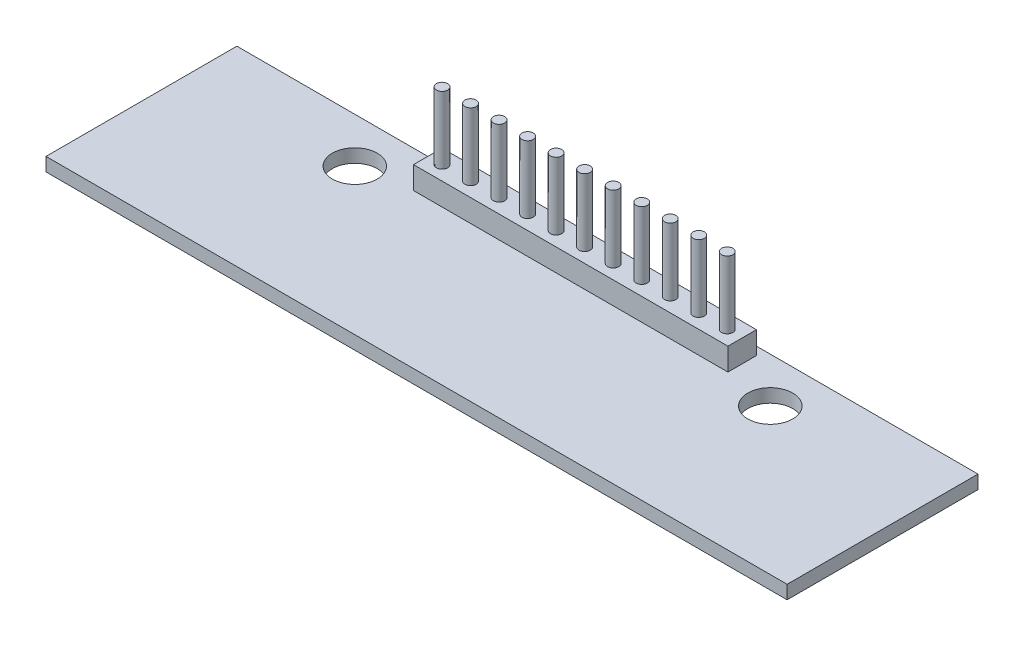
ISO-10303-21;
HEADER;
FILE_DESCRIPTION(('STEP AP214'),'2;1');
FILE_NAME('part.step','',(''),(''),'','','');
FILE_SCHEMA(('AUTOMOTIVE_DESIGN { 1 0 10303 214 1 1 1 1 }'));
ENDSEC;
DATA;
#1=APPLICATION_CONTEXT('core data for automotive mechanical design processes');
#2=APPLICATION_PROTOCOL_DEFINITION('international standard','automotive_design',2000,#1);
#3=PRODUCT_CONTEXT('',#1,'mechanical');
#4=PRODUCT('Part','Part','',(#3));
#5=PRODUCT_RELATED_PRODUCT_CATEGORY('part','',(#4));
#6=PRODUCT_DEFINITION_FORMATION('','',#4);
#7=PRODUCT_DEFINITION_CONTEXT('part definition',#1,'design');
#8=PRODUCT_DEFINITION('design','',#6,#7);
#9=PRODUCT_DEFINITION_SHAPE('','',#8);
#10=(LENGTH_UNIT() NAMED_UNIT(*) SI_UNIT(.MILLI.,.METRE.));
#11=(NAMED_UNIT(*) PLANE_ANGLE_UNIT() SI_UNIT($,.RADIAN.));
#12=(NAMED_UNIT(*) SI_UNIT($,.STERADIAN.) SOLID_ANGLE_UNIT());
#13=UNCERTAINTY_MEASURE_WITH_UNIT(LENGTH_MEASURE(1.E-05),#10,'distance_accuracy_value','');
#14=(GEOMETRIC_REPRESENTATION_CONTEXT(3) GLOBAL_UNCERTAINTY_ASSIGNED_CONTEXT((#13)) GLOBAL_UNIT_ASSIGNED_CONTEXT((#10,
#11,#12)) REPRESENTATION_CONTEXT('',''));
#15=CARTESIAN_POINT('',(0.,0.,0.));
#16=DIRECTION('',(0.,0.,1.));
#17=DIRECTION('',(1.,0.,0.));
#18=AXIS2_PLACEMENT_3D('',#15,#16,#17);
#19=CARTESIAN_POINT('',(0.,1.2,0.));
#20=DIRECTION('',(0.,1.,0.));
#21=DIRECTION('',(0.,0.,1.));
#22=AXIS2_PLACEMENT_3D('',#19,#20,#21);
#23=PLANE('',#22);
#24=CARTESIAN_POINT('',(18.5,1.2,-4.50000000000002));
#25=DIRECTION('',(0.,1.,0.));
#26=DIRECTION('',(0.,0.,1.));
#27=AXIS2_PLACEMENT_3D('',#24,#25,#26);
#28=CIRCLE('',#27,2.);
#29=CARTESIAN_POINT('',(18.5,1.2,-2.50000000000002));
#30=VERTEX_POINT('',#29);
#31=EDGE_CURVE('E148',#30,#30,#28,.T.);
#32=ORIENTED_EDGE('',*,*,#31,.F.);
#33=EDGE_LOOP('',(#32));
#34=FACE_BOUND('',#33,.T.);
#35=DIRECTION('',(0.,0.,-1.));
#36=VECTOR('',#35,1.);
#37=CARTESIAN_POINT('',(33.,1.2,-8.49999999999998));
#38=LINE('',#37,#36);
#39=CARTESIAN_POINT('',(33.,1.2,8.49999999999998));
#40=VERTEX_POINT('',#39);
#41=CARTESIAN_POINT('',(33.,1.2,-8.49999999999998));
#42=VERTEX_POINT('',#41);
#43=EDGE_CURVE('E154',#40,#42,#38,.T.);
#44=ORIENTED_EDGE('',*,*,#43,.T.);
#45=DIRECTION('',(-1.,0.,0.));
#46=VECTOR('',#45,1.);
#47=CARTESIAN_POINT('',(-33.,1.2,-8.50000000000002));
#48=LINE('',#47,#46);
#49=CARTESIAN_POINT('',(-33.,1.2,-8.50000000000002));
#50=VERTEX_POINT('',#49);
#51=EDGE_CURVE('E90',#42,#50,#48,.T.);
#52=ORIENTED_EDGE('',*,*,#51,.T.);
#53=DIRECTION('',(0.,0.,1.));
#54=VECTOR('',#53,1.);
#55=CARTESIAN_POINT('',(-33.,1.2,-8.50000000000002));
#56=LINE('',#55,#54);
#57=CARTESIAN_POINT('',(-33.,1.2,8.49999999999998));
#58=VERTEX_POINT('',#57);
#59=EDGE_CURVE('E157',#50,#58,#56,.T.);
#60=ORIENTED_EDGE('',*,*,#59,.T.);
#61=DIRECTION('',(1.,0.,0.));
#62=VECTOR('',#61,1.);
#63=CARTESIAN_POINT('',(-33.,1.2,8.49999999999998));
#64=LINE('',#63,#62);
#65=EDGE_CURVE('E62',#58,#40,#64,.T.);
#66=ORIENTED_EDGE('',*,*,#65,.T.);
#67=EDGE_LOOP('',(#44,#52,#60,#66));
#68=FACE_BOUND('',#67,.T.);
#69=CARTESIAN_POINT('',(-18.5,1.2,-4.50000000000001));
#70=DIRECTION('',(0.,1.,0.));
#71=DIRECTION('',(0.,0.,-1.));
#72=AXIS2_PLACEMENT_3D('',#69,#70,#71);
#73=CIRCLE('',#72,2.);
#74=CARTESIAN_POINT('',(-18.5,1.2,-6.50000000000001));
#75=VERTEX_POINT('',#74);
#76=EDGE_CURVE('E140',#75,#75,#73,.T.);
#77=ORIENTED_EDGE('',*,*,#76,.F.);
#78=EDGE_LOOP('',(#77));
#79=FACE_BOUND('',#78,.T.);
#80=DIRECTION('',(-1.,0.,0.));
#81=VECTOR('',#80,1.);
#82=CARTESIAN_POINT('',(-14.,1.2,-7.77000000000003));
#83=LINE('',#82,#81);
#84=CARTESIAN_POINT('',(14.,1.2,-7.77000000000003));
#85=VERTEX_POINT('',#84);
#86=CARTESIAN_POINT('',(-14.,1.2,-7.77000000000003));
#87=VERTEX_POINT('',#86);
#88=EDGE_CURVE('E383',#85,#87,#83,.T.);
#89=ORIENTED_EDGE('',*,*,#88,.F.);
#90=DIRECTION('',(0.,0.,-1.));
#91=VECTOR('',#90,1.);
#92=CARTESIAN_POINT('',(14.,1.2,-7.77000000000003));
#93=LINE('',#92,#91);
#94=CARTESIAN_POINT('',(14.,1.2,-5.23000000000003));
#95=VERTEX_POINT('',#94);
#96=EDGE_CURVE('E135',#95,#85,#93,.T.);
#97=ORIENTED_EDGE('',*,*,#96,.F.);
#98=DIRECTION('',(1.,0.,0.));
#99=VECTOR('',#98,1.);
#100=CARTESIAN_POINT('',(-14.,1.2,-5.23000000000003));
#101=LINE('',#100,#99);
#102=CARTESIAN_POINT('',(-14.,1.2,-5.23000000000003));
#103=VERTEX_POINT('',#102);
#104=EDGE_CURVE('E131',#103,#95,#101,.T.);
#105=ORIENTED_EDGE('',*,*,#104,.F.);
#106=DIRECTION('',(0.,0.,1.));
#107=VECTOR('',#106,1.);
#108=CARTESIAN_POINT('',(-14.,1.2,-7.77000000000003));
#109=LINE('',#108,#107);
#110=EDGE_CURVE('E385',#87,#103,#109,.T.);
#111=ORIENTED_EDGE('',*,*,#110,.F.);
#112=EDGE_LOOP('',(#89,#97,#105,#111));
#113=FACE_BOUND('',#112,.T.);
#114=ADVANCED_FACE('F38',(#34,#68,#79,#113),#23,.T.);
#115=CARTESIAN_POINT('',(0.,0.,0.));
#116=DIRECTION('',(0.,1.,0.));
#117=DIRECTION('',(0.,0.,1.));
#118=AXIS2_PLACEMENT_3D('',#115,#116,#117);
#119=PLANE('',#118);
#120=DIRECTION('',(0.,0.,-1.));
#121=VECTOR('',#120,1.);
#122=CARTESIAN_POINT('',(33.,0.,-8.49999999999998));
#123=LINE('',#122,#121);
#124=CARTESIAN_POINT('',(33.,0.,8.49999999999998));
#125=VERTEX_POINT('',#124);
#126=CARTESIAN_POINT('',(33.,0.,-8.49999999999998));
#127=VERTEX_POINT('',#126);
#128=EDGE_CURVE('E151',#125,#127,#123,.T.);
#129=ORIENTED_EDGE('',*,*,#128,.F.);
#130=DIRECTION('',(1.,0.,0.));
#131=VECTOR('',#130,1.);
#132=CARTESIAN_POINT('',(-33.,0.,8.49999999999998));
#133=LINE('',#132,#131);
#134=CARTESIAN_POINT('',(-33.,0.,8.49999999999998));
#135=VERTEX_POINT('',#134);
#136=EDGE_CURVE('E83',#135,#125,#133,.T.);
#137=ORIENTED_EDGE('',*,*,#136,.F.);
#138=DIRECTION('',(0.,0.,1.));
#139=VECTOR('',#138,1.);
#140=CARTESIAN_POINT('',(-33.,0.,-8.50000000000002));
#141=LINE('',#140,#139);
#142=CARTESIAN_POINT('',(-33.,0.,-8.50000000000002));
#143=VERTEX_POINT('',#142);
#144=EDGE_CURVE('E165',#143,#135,#141,.T.);
#145=ORIENTED_EDGE('',*,*,#144,.F.);
#146=DIRECTION('',(-1.,0.,0.));
#147=VECTOR('',#146,1.);
#148=CARTESIAN_POINT('',(-33.,0.,-8.50000000000002));
#149=LINE('',#148,#147);
#150=EDGE_CURVE('E163',#127,#143,#149,.T.);
#151=ORIENTED_EDGE('',*,*,#150,.F.);
#152=EDGE_LOOP('',(#129,#137,#145,#151));
#153=FACE_BOUND('',#152,.T.);
#154=CARTESIAN_POINT('',(18.5,0.,-4.50000000000002));
#155=DIRECTION('',(0.,1.,0.));
#156=DIRECTION('',(0.,0.,1.));
#157=AXIS2_PLACEMENT_3D('',#154,#155,#156);
#158=CIRCLE('',#157,2.);
#159=CARTESIAN_POINT('',(18.5,0.,-2.50000000000002));
#160=VERTEX_POINT('',#159);
#161=EDGE_CURVE('E146',#160,#160,#158,.T.);
#162=ORIENTED_EDGE('',*,*,#161,.T.);
#163=EDGE_LOOP('',(#162));
#164=FACE_BOUND('',#163,.T.);
#165=CARTESIAN_POINT('',(-18.5,0.,-4.50000000000001));
#166=DIRECTION('',(0.,1.,0.));
#167=DIRECTION('',(0.,0.,-1.));
#168=AXIS2_PLACEMENT_3D('',#165,#166,#167);
#169=CIRCLE('',#168,2.);
#170=CARTESIAN_POINT('',(-18.5,0.,-6.50000000000001));
#171=VERTEX_POINT('',#170);
#172=EDGE_CURVE('E137',#171,#171,#169,.T.);
#173=ORIENTED_EDGE('',*,*,#172,.T.);
#174=EDGE_LOOP('',(#173));
#175=FACE_BOUND('',#174,.T.);
#176=ADVANCED_FACE('F178',(#153,#164,#175),#119,.F.);
#177=CARTESIAN_POINT('',(33.,1.2,-8.49999999999998));
#178=DIRECTION('',(-1.,0.,0.));
#179=DIRECTION('',(0.,0.,1.));
#180=AXIS2_PLACEMENT_3D('',#177,#178,#179);
#181=PLANE('',#180);
#182=ORIENTED_EDGE('',*,*,#128,.T.);
#183=DIRECTION('',(0.,-1.,0.));
#184=VECTOR('',#183,1.);
#185=CARTESIAN_POINT('',(33.,1.2,-8.49999999999998));
#186=LINE('',#185,#184);
#187=EDGE_CURVE('E11',#42,#127,#186,.T.);
#188=ORIENTED_EDGE('',*,*,#187,.F.);
#189=ORIENTED_EDGE('',*,*,#43,.F.);
#190=DIRECTION('',(0.,-1.,0.));
#191=VECTOR('',#190,1.);
#192=CARTESIAN_POINT('',(33.,1.2,8.49999999999998));
#193=LINE('',#192,#191);
#194=EDGE_CURVE('E160',#40,#125,#193,.T.);
#195=ORIENTED_EDGE('',*,*,#194,.T.);
#196=EDGE_LOOP('',(#182,#188,#189,#195));
#197=FACE_BOUND('',#196,.T.);
#198=ADVANCED_FACE('F40',(#197),#181,.F.);
#199=CARTESIAN_POINT('',(-33.,1.2,-8.50000000000002));
#200=DIRECTION('',(0.,0.,1.));
#201=DIRECTION('',(1.,0.,0.));
#202=AXIS2_PLACEMENT_3D('',#199,#200,#201);
#203=PLANE('',#202);
#204=ORIENTED_EDGE('',*,*,#150,.T.);
#205=DIRECTION('',(0.,-1.,0.));
#206=VECTOR('',#205,1.);
#207=CARTESIAN_POINT('',(-33.,1.2,-8.50000000000002));
#208=LINE('',#207,#206);
#209=EDGE_CURVE('E46',#50,#143,#208,.T.);
#210=ORIENTED_EDGE('',*,*,#209,.F.);
#211=ORIENTED_EDGE('',*,*,#51,.F.);
#212=ORIENTED_EDGE('',*,*,#187,.T.);
#213=EDGE_LOOP('',(#204,#210,#211,#212));
#214=FACE_BOUND('',#213,.T.);
#215=ADVANCED_FACE('F194',(#214),#203,.F.);
#216=CARTESIAN_POINT('',(-33.,1.2,-8.50000000000002));
#217=DIRECTION('',(1.,0.,0.));
#218=DIRECTION('',(0.,0.,-1.));
#219=AXIS2_PLACEMENT_3D('',#216,#217,#218);
#220=PLANE('',#219);
#221=ORIENTED_EDGE('',*,*,#144,.T.);
#222=DIRECTION('',(0.,-1.,0.));
#223=VECTOR('',#222,1.);
#224=CARTESIAN_POINT('',(-33.,1.2,8.49999999999998));
#225=LINE('',#224,#223);
#226=EDGE_CURVE('E169',#58,#135,#225,.T.);
#227=ORIENTED_EDGE('',*,*,#226,.F.);
#228=ORIENTED_EDGE('',*,*,#59,.F.);
#229=ORIENTED_EDGE('',*,*,#209,.T.);
#230=EDGE_LOOP('',(#221,#227,#228,#229));
#231=FACE_BOUND('',#230,.T.);
#232=ADVANCED_FACE('F174',(#231),#220,.F.);
#233=CARTESIAN_POINT('',(-33.,1.2,8.49999999999998));
#234=DIRECTION('',(0.,0.,-1.));
#235=DIRECTION('',(-1.,0.,0.));
#236=AXIS2_PLACEMENT_3D('',#233,#234,#235);
#237=PLANE('',#236);
#238=ORIENTED_EDGE('',*,*,#136,.T.);
#239=ORIENTED_EDGE('',*,*,#194,.F.);
#240=ORIENTED_EDGE('',*,*,#65,.F.);
#241=ORIENTED_EDGE('',*,*,#226,.T.);
#242=EDGE_LOOP('',(#238,#239,#240,#241));
#243=FACE_BOUND('',#242,.T.);
#244=ADVANCED_FACE('F183',(#243),#237,.F.);
#245=CARTESIAN_POINT('',(18.5,1.2,-4.50000000000002));
#246=DIRECTION('',(0.,-1.,0.));
#247=DIRECTION('',(0.,0.,-1.));
#248=AXIS2_PLACEMENT_3D('',#245,#246,#247);
#249=CYLINDRICAL_SURFACE('',#248,2.);
#250=ORIENTED_EDGE('',*,*,#31,.T.);
#251=EDGE_LOOP('',(#250));
#252=FACE_BOUND('',#251,.T.);
#253=ORIENTED_EDGE('',*,*,#161,.F.);
#254=EDGE_LOOP('',(#253));
#255=FACE_BOUND('',#254,.T.);
#256=ADVANCED_FACE('F185',(#252,#255),#249,.F.);
#257=CARTESIAN_POINT('',(-18.5,1.2,-4.50000000000001));
#258=DIRECTION('',(0.,-1.,0.));
#259=DIRECTION('',(0.,0.,-1.));
#260=AXIS2_PLACEMENT_3D('',#257,#258,#259);
#261=CYLINDRICAL_SURFACE('',#260,2.);
#262=ORIENTED_EDGE('',*,*,#76,.T.);
#263=EDGE_LOOP('',(#262));
#264=FACE_BOUND('',#263,.T.);
#265=ORIENTED_EDGE('',*,*,#172,.F.);
#266=EDGE_LOOP('',(#265));
#267=FACE_BOUND('',#266,.T.);
#268=ADVANCED_FACE('F191',(#264,#267),#261,.F.);
#269=CARTESIAN_POINT('',(14.,3.2,-7.77000000000003));
#270=DIRECTION('',(-1.,0.,0.));
#271=DIRECTION('',(0.,0.,1.));
#272=AXIS2_PLACEMENT_3D('',#269,#270,#271);
#273=PLANE('',#272);
#274=ORIENTED_EDGE('',*,*,#96,.T.);
#275=DIRECTION('',(0.,-1.,0.));
#276=VECTOR('',#275,1.);
#277=CARTESIAN_POINT('',(14.,3.2,-7.77000000000003));
#278=LINE('',#277,#276);
#279=CARTESIAN_POINT('',(14.,3.2,-7.77000000000003));
#280=VERTEX_POINT('',#279);
#281=EDGE_CURVE('E116',#280,#85,#278,.T.);
#282=ORIENTED_EDGE('',*,*,#281,.F.);
#283=DIRECTION('',(0.,0.,-1.));
#284=VECTOR('',#283,1.);
#285=CARTESIAN_POINT('',(14.,3.2,-7.77000000000003));
#286=LINE('',#285,#284);
#287=CARTESIAN_POINT('',(14.,3.2,-5.23000000000003));
#288=VERTEX_POINT('',#287);
#289=EDGE_CURVE('E123',#288,#280,#286,.T.);
#290=ORIENTED_EDGE('',*,*,#289,.F.);
#291=DIRECTION('',(0.,-1.,0.));
#292=VECTOR('',#291,1.);
#293=CARTESIAN_POINT('',(14.,3.2,-5.23000000000003));
#294=LINE('',#293,#292);
#295=EDGE_CURVE('E381',#288,#95,#294,.T.);
#296=ORIENTED_EDGE('',*,*,#295,.T.);
#297=EDGE_LOOP('',(#274,#282,#290,#296));
#298=FACE_BOUND('',#297,.T.);
#299=ADVANCED_FACE('F133',(#298),#273,.F.);
#300=CARTESIAN_POINT('',(-14.,3.2,-7.77000000000003));
#301=DIRECTION('',(0.,0.,1.));
#302=DIRECTION('',(1.,0.,0.));
#303=AXIS2_PLACEMENT_3D('',#300,#301,#302);
#304=PLANE('',#303);
#305=ORIENTED_EDGE('',*,*,#88,.T.);
#306=DIRECTION('',(0.,-1.,0.));
#307=VECTOR('',#306,1.);
#308=CARTESIAN_POINT('',(-14.,3.2,-7.77000000000003));
#309=LINE('',#308,#307);
#310=CARTESIAN_POINT('',(-14.,3.2,-7.77000000000003));
#311=VERTEX_POINT('',#310);
#312=EDGE_CURVE('E119',#311,#87,#309,.T.);
#313=ORIENTED_EDGE('',*,*,#312,.F.);
#314=DIRECTION('',(-1.,0.,0.));
#315=VECTOR('',#314,1.);
#316=CARTESIAN_POINT('',(-14.,3.2,-7.77000000000003));
#317=LINE('',#316,#315);
#318=EDGE_CURVE('E112',#280,#311,#317,.T.);
#319=ORIENTED_EDGE('',*,*,#318,.F.);
#320=ORIENTED_EDGE('',*,*,#281,.T.);
#321=EDGE_LOOP('',(#305,#313,#319,#320));
#322=FACE_BOUND('',#321,.T.);
#323=ADVANCED_FACE('F114',(#322),#304,.F.);
#324=CARTESIAN_POINT('',(-14.,3.2,-7.77000000000003));
#325=DIRECTION('',(1.,0.,0.));
#326=DIRECTION('',(0.,0.,-1.));
#327=AXIS2_PLACEMENT_3D('',#324,#325,#326);
#328=PLANE('',#327);
#329=ORIENTED_EDGE('',*,*,#110,.T.);
#330=DIRECTION('',(0.,-1.,0.));
#331=VECTOR('',#330,1.);
#332=CARTESIAN_POINT('',(-14.,3.2,-5.23000000000003));
#333=LINE('',#332,#331);
#334=CARTESIAN_POINT('',(-14.,3.2,-5.23000000000003));
#335=VERTEX_POINT('',#334);
#336=EDGE_CURVE('E53',#335,#103,#333,.T.);
#337=ORIENTED_EDGE('',*,*,#336,.F.);
#338=DIRECTION('',(0.,0.,1.));
#339=VECTOR('',#338,1.);
#340=CARTESIAN_POINT('',(-14.,3.2,-7.77000000000003));
#341=LINE('',#340,#339);
#342=EDGE_CURVE('E122',#311,#335,#341,.T.);
#343=ORIENTED_EDGE('',*,*,#342,.F.);
#344=ORIENTED_EDGE('',*,*,#312,.T.);
#345=EDGE_LOOP('',(#329,#337,#343,#344));
#346=FACE_BOUND('',#345,.T.);
#347=ADVANCED_FACE('F212',(#346),#328,.F.);
#348=CARTESIAN_POINT('',(-14.,3.2,-5.23000000000003));
#349=DIRECTION('',(0.,0.,-1.));
#350=DIRECTION('',(-1.,0.,0.));
#351=AXIS2_PLACEMENT_3D('',#348,#349,#350);
#352=PLANE('',#351);
#353=ORIENTED_EDGE('',*,*,#104,.T.);
#354=ORIENTED_EDGE('',*,*,#295,.F.);
#355=DIRECTION('',(1.,0.,0.));
#356=VECTOR('',#355,1.);
#357=CARTESIAN_POINT('',(-14.,3.2,-5.23000000000003));
#358=LINE('',#357,#356);
#359=EDGE_CURVE('E127',#335,#288,#358,.T.);
#360=ORIENTED_EDGE('',*,*,#359,.F.);
#361=ORIENTED_EDGE('',*,*,#336,.T.);
#362=EDGE_LOOP('',(#353,#354,#360,#361));
#363=FACE_BOUND('',#362,.T.);
#364=ADVANCED_FACE('F215',(#363),#352,.F.);
#365=CARTESIAN_POINT('',(0.,3.2,0.));
#366=DIRECTION('',(0.,1.,0.));
#367=DIRECTION('',(0.,0.,1.));
#368=AXIS2_PLACEMENT_3D('',#365,#366,#367);
#369=PLANE('',#368);
#370=CARTESIAN_POINT('',(12.67,3.2,-6.50000000000003));
#371=DIRECTION('',(0.,1.,0.));
#372=DIRECTION('',(0.,0.,1.));
#373=AXIS2_PLACEMENT_3D('',#370,#371,#372);
#374=CIRCLE('',#373,0.499999999999999);
#375=CARTESIAN_POINT('',(12.67,3.2,-6.00000000000003));
#376=VERTEX_POINT('',#375);
#377=EDGE_CURVE('E315',#376,#376,#374,.T.);
#378=ORIENTED_EDGE('',*,*,#377,.F.);
#379=EDGE_LOOP('',(#378));
#380=FACE_BOUND('',#379,.T.);
#381=CARTESIAN_POINT('',(10.13,3.2,-6.50000000000003));
#382=DIRECTION('',(0.,1.,0.));
#383=DIRECTION('',(0.,0.,1.));
#384=AXIS2_PLACEMENT_3D('',#381,#382,#383);
#385=CIRCLE('',#384,0.499999999999999);
#386=CARTESIAN_POINT('',(10.13,3.2,-6.00000000000003));
#387=VERTEX_POINT('',#386);
#388=EDGE_CURVE('E314',#387,#387,#385,.T.);
#389=ORIENTED_EDGE('',*,*,#388,.F.);
#390=EDGE_LOOP('',(#389));
#391=FACE_BOUND('',#390,.T.);
#392=CARTESIAN_POINT('',(7.59000000000001,3.2,-6.50000000000003));
#393=DIRECTION('',(0.,1.,0.));
#394=DIRECTION('',(0.,0.,1.));
#395=AXIS2_PLACEMENT_3D('',#392,#393,#394);
#396=CIRCLE('',#395,0.499999999999999);
#397=CARTESIAN_POINT('',(7.59000000000001,3.2,-6.00000000000003));
#398=VERTEX_POINT('',#397);
#399=EDGE_CURVE('E324',#398,#398,#396,.T.);
#400=ORIENTED_EDGE('',*,*,#399,.F.);
#401=EDGE_LOOP('',(#400));
#402=FACE_BOUND('',#401,.T.);
#403=CARTESIAN_POINT('',(5.05000000000001,3.2,-6.50000000000003));
#404=DIRECTION('',(0.,1.,0.));
#405=DIRECTION('',(0.,0.,1.));
#406=AXIS2_PLACEMENT_3D('',#403,#404,#405);
#407=CIRCLE('',#406,0.499999999999999);
#408=CARTESIAN_POINT('',(5.05000000000001,3.2,-6.00000000000003));
#409=VERTEX_POINT('',#408);
#410=EDGE_CURVE('E329',#409,#409,#407,.T.);
#411=ORIENTED_EDGE('',*,*,#410,.F.);
#412=EDGE_LOOP('',(#411));
#413=FACE_BOUND('',#412,.T.);
#414=CARTESIAN_POINT('',(2.51000000000001,3.2,-6.50000000000003));
#415=DIRECTION('',(0.,1.,0.));
#416=DIRECTION('',(0.,0.,1.));
#417=AXIS2_PLACEMENT_3D('',#414,#415,#416);
#418=CIRCLE('',#417,0.499999999999999);
#419=CARTESIAN_POINT('',(2.51000000000001,3.2,-6.00000000000003));
#420=VERTEX_POINT('',#419);
#421=EDGE_CURVE('E335',#420,#420,#418,.T.);
#422=ORIENTED_EDGE('',*,*,#421,.F.);
#423=EDGE_LOOP('',(#422));
#424=FACE_BOUND('',#423,.T.);
#425=CARTESIAN_POINT('',(-0.0299999999999936,3.2,-6.50000000000003));
#426=DIRECTION('',(0.,1.,0.));
#427=DIRECTION('',(0.,0.,1.));
#428=AXIS2_PLACEMENT_3D('',#425,#426,#427);
#429=CIRCLE('',#428,0.499999999999999);
#430=CARTESIAN_POINT('',(-0.0299999999999936,3.2,-6.00000000000003));
#431=VERTEX_POINT('',#430);
#432=EDGE_CURVE('E341',#431,#431,#429,.T.);
#433=ORIENTED_EDGE('',*,*,#432,.F.);
#434=EDGE_LOOP('',(#433));
#435=FACE_BOUND('',#434,.T.);
#436=CARTESIAN_POINT('',(-2.56999999999999,3.2,-6.50000000000003));
#437=DIRECTION('',(0.,1.,0.));
#438=DIRECTION('',(0.,0.,1.));
#439=AXIS2_PLACEMENT_3D('',#436,#437,#438);
#440=CIRCLE('',#439,0.499999999999999);
#441=CARTESIAN_POINT('',(-2.56999999999999,3.2,-6.00000000000003));
#442=VERTEX_POINT('',#441);
#443=EDGE_CURVE('E347',#442,#442,#440,.T.);
#444=ORIENTED_EDGE('',*,*,#443,.F.);
#445=EDGE_LOOP('',(#444));
#446=FACE_BOUND('',#445,.T.);
#447=CARTESIAN_POINT('',(-5.10999999999999,3.2,-6.50000000000003));
#448=DIRECTION('',(0.,1.,0.));
#449=DIRECTION('',(0.,0.,1.));
#450=AXIS2_PLACEMENT_3D('',#447,#448,#449);
#451=CIRCLE('',#450,0.499999999999999);
#452=CARTESIAN_POINT('',(-5.10999999999999,3.2,-6.00000000000003));
#453=VERTEX_POINT('',#452);
#454=EDGE_CURVE('E353',#453,#453,#451,.T.);
#455=ORIENTED_EDGE('',*,*,#454,.F.);
#456=EDGE_LOOP('',(#455));
#457=FACE_BOUND('',#456,.T.);
#458=CARTESIAN_POINT('',(-7.64999999999999,3.2,-6.50000000000003));
#459=DIRECTION('',(0.,1.,0.));
#460=DIRECTION('',(0.,0.,1.));
#461=AXIS2_PLACEMENT_3D('',#458,#459,#460);
#462=CIRCLE('',#461,0.499999999999999);
#463=CARTESIAN_POINT('',(-7.64999999999999,3.2,-6.00000000000003));
#464=VERTEX_POINT('',#463);
#465=EDGE_CURVE('E359',#464,#464,#462,.T.);
#466=ORIENTED_EDGE('',*,*,#465,.F.);
#467=EDGE_LOOP('',(#466));
#468=FACE_BOUND('',#467,.T.);
#469=CARTESIAN_POINT('',(-10.19,3.2,-6.50000000000003));
#470=DIRECTION('',(0.,1.,0.));
#471=DIRECTION('',(0.,0.,1.));
#472=AXIS2_PLACEMENT_3D('',#469,#470,#471);
#473=CIRCLE('',#472,0.499999999999999);
#474=CARTESIAN_POINT('',(-10.19,3.2,-6.00000000000003));
#475=VERTEX_POINT('',#474);
#476=EDGE_CURVE('E365',#475,#475,#473,.T.);
#477=ORIENTED_EDGE('',*,*,#476,.F.);
#478=EDGE_LOOP('',(#477));
#479=FACE_BOUND('',#478,.T.);
#480=CARTESIAN_POINT('',(-12.73,3.2,-6.50000000000003));
#481=DIRECTION('',(0.,1.,0.));
#482=DIRECTION('',(0.,0.,1.));
#483=AXIS2_PLACEMENT_3D('',#480,#481,#482);
#484=CIRCLE('',#483,0.499999999999999);
#485=CARTESIAN_POINT('',(-12.73,3.2,-6.00000000000003));
#486=VERTEX_POINT('',#485);
#487=EDGE_CURVE('E371',#486,#486,#484,.T.);
#488=ORIENTED_EDGE('',*,*,#487,.F.);
#489=EDGE_LOOP('',(#488));
#490=FACE_BOUND('',#489,.T.);
#491=ORIENTED_EDGE('',*,*,#289,.T.);
#492=ORIENTED_EDGE('',*,*,#318,.T.);
#493=ORIENTED_EDGE('',*,*,#342,.T.);
#494=ORIENTED_EDGE('',*,*,#359,.T.);
#495=EDGE_LOOP('',(#491,#492,#493,#494));
#496=FACE_BOUND('',#495,.T.);
#497=ADVANCED_FACE('F126',(#380,#391,#402,#413,#424,#435,#446,#457,#468,#479,#490,#496),#369,.T.);
#498=CARTESIAN_POINT('',(-12.73,9.2,-6.50000000000003));
#499=DIRECTION('',(0.,-1.,0.));
#500=DIRECTION('',(0.,0.,-1.));
#501=AXIS2_PLACEMENT_3D('',#498,#499,#500);
#502=CYLINDRICAL_SURFACE('',#501,0.499999999999999);
#503=CARTESIAN_POINT('',(-12.73,9.2,-6.50000000000003));
#504=DIRECTION('',(0.,1.,0.));
#505=DIRECTION('',(0.,0.,1.));
#506=AXIS2_PLACEMENT_3D('',#503,#504,#505);
#507=CIRCLE('',#506,0.499999999999999);
#508=CARTESIAN_POINT('',(-12.73,9.2,-6.00000000000003));
#509=VERTEX_POINT('',#508);
#510=EDGE_CURVE('E374',#509,#509,#507,.T.);
#511=ORIENTED_EDGE('',*,*,#510,.F.);
#512=EDGE_LOOP('',(#511));
#513=FACE_BOUND('',#512,.T.);
#514=ORIENTED_EDGE('',*,*,#487,.T.);
#515=EDGE_LOOP('',(#514));
#516=FACE_BOUND('',#515,.T.);
#517=ADVANCED_FACE('F221',(#513,#516),#502,.T.);
#518=CARTESIAN_POINT('',(-12.73,9.2,-6.50000000000003));
#519=DIRECTION('',(0.,1.,0.));
#520=DIRECTION('',(0.,0.,1.));
#521=AXIS2_PLACEMENT_3D('',#518,#519,#520);
#522=PLANE('',#521);
#523=ORIENTED_EDGE('',*,*,#510,.T.);
#524=EDGE_LOOP('',(#523));
#525=FACE_BOUND('',#524,.T.);
#526=ADVANCED_FACE('F225',(#525),#522,.T.);
#527=CARTESIAN_POINT('',(-10.19,9.2,-6.50000000000003));
#528=DIRECTION('',(0.,-1.,0.));
#529=DIRECTION('',(0.,0.,-1.));
#530=AXIS2_PLACEMENT_3D('',#527,#528,#529);
#531=CYLINDRICAL_SURFACE('',#530,0.499999999999999);
#532=CARTESIAN_POINT('',(-10.19,9.2,-6.50000000000003));
#533=DIRECTION('',(0.,1.,0.));
#534=DIRECTION('',(0.,0.,1.));
#535=AXIS2_PLACEMENT_3D('',#532,#533,#534);
#536=CIRCLE('',#535,0.499999999999999);
#537=CARTESIAN_POINT('',(-10.19,9.2,-6.00000000000003));
#538=VERTEX_POINT('',#537);
#539=EDGE_CURVE('E368',#538,#538,#536,.T.);
#540=ORIENTED_EDGE('',*,*,#539,.F.);
#541=EDGE_LOOP('',(#540));
#542=FACE_BOUND('',#541,.T.);
#543=ORIENTED_EDGE('',*,*,#476,.T.);
#544=EDGE_LOOP('',(#543));
#545=FACE_BOUND('',#544,.T.);
#546=ADVANCED_FACE('F229',(#542,#545),#531,.T.);
#547=CARTESIAN_POINT('',(-10.19,9.2,-6.50000000000003));
#548=DIRECTION('',(0.,1.,0.));
#549=DIRECTION('',(0.,0.,1.));
#550=AXIS2_PLACEMENT_3D('',#547,#548,#549);
#551=PLANE('',#550);
#552=ORIENTED_EDGE('',*,*,#539,.T.);
#553=EDGE_LOOP('',(#552));
#554=FACE_BOUND('',#553,.T.);
#555=ADVANCED_FACE('F233',(#554),#551,.T.);
#556=CARTESIAN_POINT('',(-7.64999999999999,9.2,-6.50000000000003));
#557=DIRECTION('',(0.,-1.,0.));
#558=DIRECTION('',(0.,0.,-1.));
#559=AXIS2_PLACEMENT_3D('',#556,#557,#558);
#560=CYLINDRICAL_SURFACE('',#559,0.499999999999999);
#561=CARTESIAN_POINT('',(-7.64999999999999,9.2,-6.50000000000003));
#562=DIRECTION('',(0.,1.,0.));
#563=DIRECTION('',(0.,0.,1.));
#564=AXIS2_PLACEMENT_3D('',#561,#562,#563);
#565=CIRCLE('',#564,0.499999999999999);
#566=CARTESIAN_POINT('',(-7.64999999999999,9.2,-6.00000000000003));
#567=VERTEX_POINT('',#566);
#568=EDGE_CURVE('E362',#567,#567,#565,.T.);
#569=ORIENTED_EDGE('',*,*,#568,.F.);
#570=EDGE_LOOP('',(#569));
#571=FACE_BOUND('',#570,.T.);
#572=ORIENTED_EDGE('',*,*,#465,.T.);
#573=EDGE_LOOP('',(#572));
#574=FACE_BOUND('',#573,.T.);
#575=ADVANCED_FACE('F237',(#571,#574),#560,.T.);
#576=CARTESIAN_POINT('',(-7.64999999999999,9.2,-6.50000000000003));
#577=DIRECTION('',(0.,1.,0.));
#578=DIRECTION('',(0.,0.,1.));
#579=AXIS2_PLACEMENT_3D('',#576,#577,#578);
#580=PLANE('',#579);
#581=ORIENTED_EDGE('',*,*,#568,.T.);
#582=EDGE_LOOP('',(#581));
#583=FACE_BOUND('',#582,.T.);
#584=ADVANCED_FACE('F241',(#583),#580,.T.);
#585=CARTESIAN_POINT('',(-5.10999999999999,9.2,-6.50000000000003));
#586=DIRECTION('',(0.,-1.,0.));
#587=DIRECTION('',(0.,0.,-1.));
#588=AXIS2_PLACEMENT_3D('',#585,#586,#587);
#589=CYLINDRICAL_SURFACE('',#588,0.499999999999999);
#590=CARTESIAN_POINT('',(-5.10999999999999,9.2,-6.50000000000003));
#591=DIRECTION('',(0.,1.,0.));
#592=DIRECTION('',(0.,0.,1.));
#593=AXIS2_PLACEMENT_3D('',#590,#591,#592);
#594=CIRCLE('',#593,0.499999999999999);
#595=CARTESIAN_POINT('',(-5.10999999999999,9.2,-6.00000000000003));
#596=VERTEX_POINT('',#595);
#597=EDGE_CURVE('E356',#596,#596,#594,.T.);
#598=ORIENTED_EDGE('',*,*,#597,.F.);
#599=EDGE_LOOP('',(#598));
#600=FACE_BOUND('',#599,.T.);
#601=ORIENTED_EDGE('',*,*,#454,.T.);
#602=EDGE_LOOP('',(#601));
#603=FACE_BOUND('',#602,.T.);
#604=ADVANCED_FACE('F245',(#600,#603),#589,.T.);
#605=CARTESIAN_POINT('',(-5.10999999999999,9.2,-6.50000000000003));
#606=DIRECTION('',(0.,1.,0.));
#607=DIRECTION('',(0.,0.,1.));
#608=AXIS2_PLACEMENT_3D('',#605,#606,#607);
#609=PLANE('',#608);
#610=ORIENTED_EDGE('',*,*,#597,.T.);
#611=EDGE_LOOP('',(#610));
#612=FACE_BOUND('',#611,.T.);
#613=ADVANCED_FACE('F249',(#612),#609,.T.);
#614=CARTESIAN_POINT('',(-2.56999999999999,9.2,-6.50000000000003));
#615=DIRECTION('',(0.,-1.,0.));
#616=DIRECTION('',(0.,0.,-1.));
#617=AXIS2_PLACEMENT_3D('',#614,#615,#616);
#618=CYLINDRICAL_SURFACE('',#617,0.499999999999999);
#619=CARTESIAN_POINT('',(-2.56999999999999,9.2,-6.50000000000003));
#620=DIRECTION('',(0.,1.,0.));
#621=DIRECTION('',(0.,0.,1.));
#622=AXIS2_PLACEMENT_3D('',#619,#620,#621);
#623=CIRCLE('',#622,0.499999999999999);
#624=CARTESIAN_POINT('',(-2.56999999999999,9.2,-6.00000000000003));
#625=VERTEX_POINT('',#624);
#626=EDGE_CURVE('E350',#625,#625,#623,.T.);
#627=ORIENTED_EDGE('',*,*,#626,.F.);
#628=EDGE_LOOP('',(#627));
#629=FACE_BOUND('',#628,.T.);
#630=ORIENTED_EDGE('',*,*,#443,.T.);
#631=EDGE_LOOP('',(#630));
#632=FACE_BOUND('',#631,.T.);
#633=ADVANCED_FACE('F253',(#629,#632),#618,.T.);
#634=CARTESIAN_POINT('',(-2.56999999999999,9.2,-6.50000000000003));
#635=DIRECTION('',(0.,1.,0.));
#636=DIRECTION('',(0.,0.,1.));
#637=AXIS2_PLACEMENT_3D('',#634,#635,#636);
#638=PLANE('',#637);
#639=ORIENTED_EDGE('',*,*,#626,.T.);
#640=EDGE_LOOP('',(#639));
#641=FACE_BOUND('',#640,.T.);
#642=ADVANCED_FACE('F257',(#641),#638,.T.);
#643=CARTESIAN_POINT('',(-0.0299999999999936,9.2,-6.50000000000003));
#644=DIRECTION('',(0.,-1.,0.));
#645=DIRECTION('',(0.,0.,-1.));
#646=AXIS2_PLACEMENT_3D('',#643,#644,#645);
#647=CYLINDRICAL_SURFACE('',#646,0.499999999999999);
#648=CARTESIAN_POINT('',(-0.0299999999999936,9.2,-6.50000000000003));
#649=DIRECTION('',(0.,1.,0.));
#650=DIRECTION('',(0.,0.,1.));
#651=AXIS2_PLACEMENT_3D('',#648,#649,#650);
#652=CIRCLE('',#651,0.499999999999999);
#653=CARTESIAN_POINT('',(-0.0299999999999936,9.2,-6.00000000000003));
#654=VERTEX_POINT('',#653);
#655=EDGE_CURVE('E344',#654,#654,#652,.T.);
#656=ORIENTED_EDGE('',*,*,#655,.F.);
#657=EDGE_LOOP('',(#656));
#658=FACE_BOUND('',#657,.T.);
#659=ORIENTED_EDGE('',*,*,#432,.T.);
#660=EDGE_LOOP('',(#659));
#661=FACE_BOUND('',#660,.T.);
#662=ADVANCED_FACE('F261',(#658,#661),#647,.T.);
#663=CARTESIAN_POINT('',(-0.0299999999999936,9.2,-6.50000000000003));
#664=DIRECTION('',(0.,1.,0.));
#665=DIRECTION('',(0.,0.,1.));
#666=AXIS2_PLACEMENT_3D('',#663,#664,#665);
#667=PLANE('',#666);
#668=ORIENTED_EDGE('',*,*,#655,.T.);
#669=EDGE_LOOP('',(#668));
#670=FACE_BOUND('',#669,.T.);
#671=ADVANCED_FACE('F265',(#670),#667,.T.);
#672=CARTESIAN_POINT('',(2.51000000000001,9.2,-6.50000000000003));
#673=DIRECTION('',(0.,-1.,0.));
#674=DIRECTION('',(0.,0.,-1.));
#675=AXIS2_PLACEMENT_3D('',#672,#673,#674);
#676=CYLINDRICAL_SURFACE('',#675,0.499999999999999);
#677=CARTESIAN_POINT('',(2.51000000000001,9.2,-6.50000000000003));
#678=DIRECTION('',(0.,1.,0.));
#679=DIRECTION('',(0.,0.,1.));
#680=AXIS2_PLACEMENT_3D('',#677,#678,#679);
#681=CIRCLE('',#680,0.499999999999999);
#682=CARTESIAN_POINT('',(2.51000000000001,9.2,-6.00000000000003));
#683=VERTEX_POINT('',#682);
#684=EDGE_CURVE('E338',#683,#683,#681,.T.);
#685=ORIENTED_EDGE('',*,*,#684,.F.);
#686=EDGE_LOOP('',(#685));
#687=FACE_BOUND('',#686,.T.);
#688=ORIENTED_EDGE('',*,*,#421,.T.);
#689=EDGE_LOOP('',(#688));
#690=FACE_BOUND('',#689,.T.);
#691=ADVANCED_FACE('F269',(#687,#690),#676,.T.);
#692=CARTESIAN_POINT('',(2.51000000000001,9.2,-6.50000000000003));
#693=DIRECTION('',(0.,1.,0.));
#694=DIRECTION('',(0.,0.,1.));
#695=AXIS2_PLACEMENT_3D('',#692,#693,#694);
#696=PLANE('',#695);
#697=ORIENTED_EDGE('',*,*,#684,.T.);
#698=EDGE_LOOP('',(#697));
#699=FACE_BOUND('',#698,.T.);
#700=ADVANCED_FACE('F273',(#699),#696,.T.);
#701=CARTESIAN_POINT('',(5.05000000000001,9.2,-6.50000000000003));
#702=DIRECTION('',(0.,-1.,0.));
#703=DIRECTION('',(0.,0.,-1.));
#704=AXIS2_PLACEMENT_3D('',#701,#702,#703);
#705=CYLINDRICAL_SURFACE('',#704,0.499999999999999);
#706=CARTESIAN_POINT('',(5.05000000000001,9.2,-6.50000000000003));
#707=DIRECTION('',(0.,1.,0.));
#708=DIRECTION('',(0.,0.,1.));
#709=AXIS2_PLACEMENT_3D('',#706,#707,#708);
#710=CIRCLE('',#709,0.499999999999999);
#711=CARTESIAN_POINT('',(5.05000000000001,9.2,-6.00000000000003));
#712=VERTEX_POINT('',#711);
#713=EDGE_CURVE('E332',#712,#712,#710,.T.);
#714=ORIENTED_EDGE('',*,*,#713,.F.);
#715=EDGE_LOOP('',(#714));
#716=FACE_BOUND('',#715,.T.);
#717=ORIENTED_EDGE('',*,*,#410,.T.);
#718=EDGE_LOOP('',(#717));
#719=FACE_BOUND('',#718,.T.);
#720=ADVANCED_FACE('F277',(#716,#719),#705,.T.);
#721=CARTESIAN_POINT('',(5.05000000000001,9.2,-6.50000000000003));
#722=DIRECTION('',(0.,1.,0.));
#723=DIRECTION('',(0.,0.,1.));
#724=AXIS2_PLACEMENT_3D('',#721,#722,#723);
#725=PLANE('',#724);
#726=ORIENTED_EDGE('',*,*,#713,.T.);
#727=EDGE_LOOP('',(#726));
#728=FACE_BOUND('',#727,.T.);
#729=ADVANCED_FACE('F281',(#728),#725,.T.);
#730=CARTESIAN_POINT('',(7.59000000000001,9.2,-6.50000000000003));
#731=DIRECTION('',(0.,-1.,0.));
#732=DIRECTION('',(0.,0.,-1.));
#733=AXIS2_PLACEMENT_3D('',#730,#731,#732);
#734=CYLINDRICAL_SURFACE('',#733,0.499999999999999);
#735=CARTESIAN_POINT('',(7.59000000000001,9.2,-6.50000000000003));
#736=DIRECTION('',(0.,1.,0.));
#737=DIRECTION('',(0.,0.,1.));
#738=AXIS2_PLACEMENT_3D('',#735,#736,#737);
#739=CIRCLE('',#738,0.499999999999999);
#740=CARTESIAN_POINT('',(7.59000000000001,9.2,-6.00000000000003));
#741=VERTEX_POINT('',#740);
#742=EDGE_CURVE('E326',#741,#741,#739,.T.);
#743=ORIENTED_EDGE('',*,*,#742,.F.);
#744=EDGE_LOOP('',(#743));
#745=FACE_BOUND('',#744,.T.);
#746=ORIENTED_EDGE('',*,*,#399,.T.);
#747=EDGE_LOOP('',(#746));
#748=FACE_BOUND('',#747,.T.);
#749=ADVANCED_FACE('F285',(#745,#748),#734,.T.);
#750=CARTESIAN_POINT('',(7.59000000000001,9.2,-6.50000000000003));
#751=DIRECTION('',(0.,1.,0.));
#752=DIRECTION('',(0.,0.,1.));
#753=AXIS2_PLACEMENT_3D('',#750,#751,#752);
#754=PLANE('',#753);
#755=ORIENTED_EDGE('',*,*,#742,.T.);
#756=EDGE_LOOP('',(#755));
#757=FACE_BOUND('',#756,.T.);
#758=ADVANCED_FACE('F289',(#757),#754,.T.);
#759=CARTESIAN_POINT('',(10.13,9.2,-6.50000000000003));
#760=DIRECTION('',(0.,-1.,0.));
#761=DIRECTION('',(0.,0.,-1.));
#762=AXIS2_PLACEMENT_3D('',#759,#760,#761);
#763=CYLINDRICAL_SURFACE('',#762,0.499999999999999);
#764=CARTESIAN_POINT('',(10.13,9.2,-6.50000000000003));
#765=DIRECTION('',(0.,1.,0.));
#766=DIRECTION('',(0.,0.,1.));
#767=AXIS2_PLACEMENT_3D('',#764,#765,#766);
#768=CIRCLE('',#767,0.499999999999999);
#769=CARTESIAN_POINT('',(10.13,9.2,-6.00000000000003));
#770=VERTEX_POINT('',#769);
#771=EDGE_CURVE('E318',#770,#770,#768,.T.);
#772=ORIENTED_EDGE('',*,*,#771,.F.);
#773=EDGE_LOOP('',(#772));
#774=FACE_BOUND('',#773,.T.);
#775=ORIENTED_EDGE('',*,*,#388,.T.);
#776=EDGE_LOOP('',(#775));
#777=FACE_BOUND('',#776,.T.);
#778=ADVANCED_FACE('F293',(#774,#777),#763,.T.);
#779=CARTESIAN_POINT('',(10.13,9.2,-6.50000000000003));
#780=DIRECTION('',(0.,1.,0.));
#781=DIRECTION('',(0.,0.,1.));
#782=AXIS2_PLACEMENT_3D('',#779,#780,#781);
#783=PLANE('',#782);
#784=ORIENTED_EDGE('',*,*,#771,.T.);
#785=EDGE_LOOP('',(#784));
#786=FACE_BOUND('',#785,.T.);
#787=ADVANCED_FACE('F297',(#786),#783,.T.);
#788=CARTESIAN_POINT('',(12.67,9.2,-6.50000000000003));
#789=DIRECTION('',(0.,-1.,0.));
#790=DIRECTION('',(0.,0.,-1.));
#791=AXIS2_PLACEMENT_3D('',#788,#789,#790);
#792=CYLINDRICAL_SURFACE('',#791,0.499999999999999);
#793=CARTESIAN_POINT('',(12.67,9.2,-6.50000000000003));
#794=DIRECTION('',(0.,1.,0.));
#795=DIRECTION('',(0.,0.,1.));
#796=AXIS2_PLACEMENT_3D('',#793,#794,#795);
#797=CIRCLE('',#796,0.499999999999999);
#798=CARTESIAN_POINT('',(12.67,9.2,-6.00000000000003));
#799=VERTEX_POINT('',#798);
#800=EDGE_CURVE('E313',#799,#799,#797,.T.);
#801=ORIENTED_EDGE('',*,*,#800,.F.);
#802=EDGE_LOOP('',(#801));
#803=FACE_BOUND('',#802,.T.);
#804=ORIENTED_EDGE('',*,*,#377,.T.);
#805=EDGE_LOOP('',(#804));
#806=FACE_BOUND('',#805,.T.);
#807=ADVANCED_FACE('F301',(#803,#806),#792,.T.);
#808=CARTESIAN_POINT('',(12.67,9.2,-6.50000000000003));
#809=DIRECTION('',(0.,1.,0.));
#810=DIRECTION('',(0.,0.,1.));
#811=AXIS2_PLACEMENT_3D('',#808,#809,#810);
#812=PLANE('',#811);
#813=ORIENTED_EDGE('',*,*,#800,.T.);
#814=EDGE_LOOP('',(#813));
#815=FACE_BOUND('',#814,.T.);
#816=ADVANCED_FACE('F305',(#815),#812,.T.);
#817=CLOSED_SHELL('',(#114,#176,#198,#215,#232,#244,#256,#268,#299,#323,#347,#364,#497,#517,
#526,#546,#555,#575,#584,#604,#613,#633,#642,#662,#671,#691,#700,#720,#729,#749,#758,#778,#787,
#807,#816));
#818=MANIFOLD_SOLID_BREP('B2',#817);
#819=ADVANCED_BREP_SHAPE_REPRESENTATION('',(#18,#818),#14);
#820=SHAPE_DEFINITION_REPRESENTATION(#9,#819);
ENDSEC;
END-ISO-10303-21;
